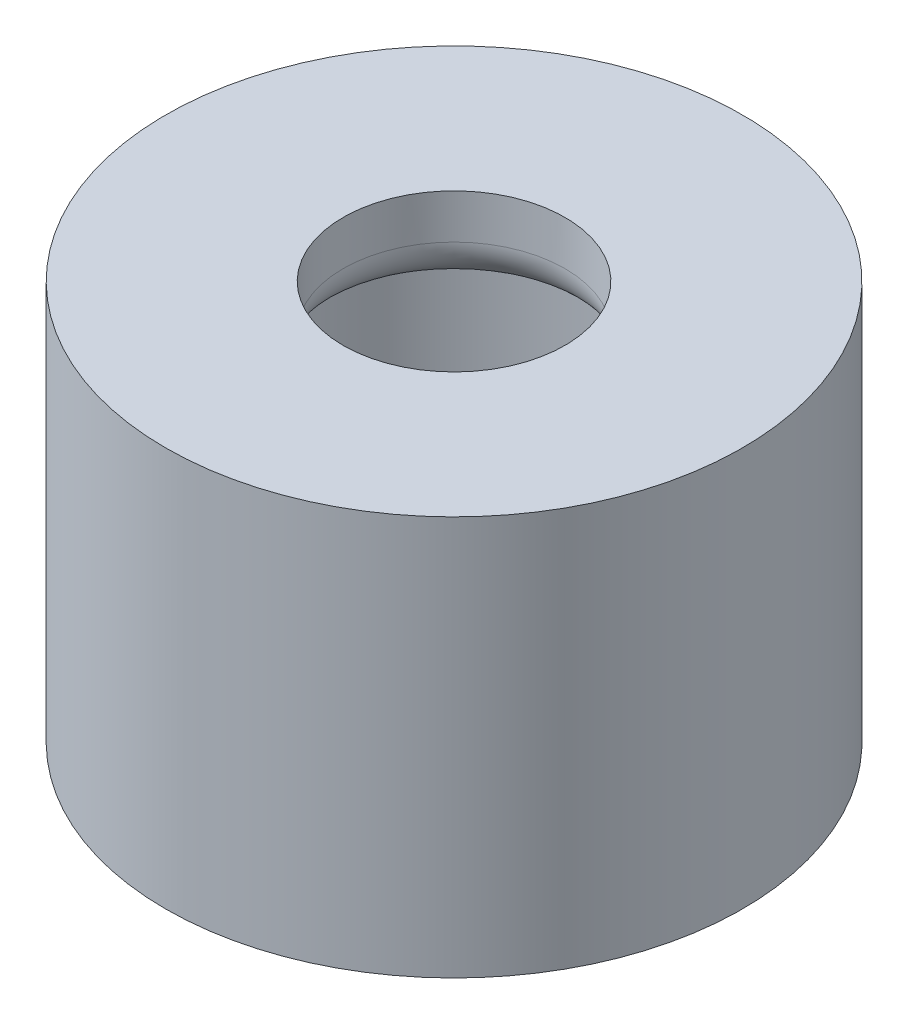
ISO-10303-21;
HEADER;
FILE_DESCRIPTION(('STEP AP214'),'2;1');
FILE_NAME('part.step','',(''),(''),'','','');
FILE_SCHEMA(('AUTOMOTIVE_DESIGN { 1 0 10303 214 1 1 1 1 }'));
ENDSEC;
DATA;
#1=APPLICATION_CONTEXT('core data for automotive mechanical design processes');
#2=APPLICATION_PROTOCOL_DEFINITION('international standard','automotive_design',2000,#1);
#3=PRODUCT_CONTEXT('',#1,'mechanical');
#4=PRODUCT('Part','Part','',(#3));
#5=PRODUCT_RELATED_PRODUCT_CATEGORY('part','',(#4));
#6=PRODUCT_DEFINITION_FORMATION('','',#4);
#7=PRODUCT_DEFINITION_CONTEXT('part definition',#1,'design');
#8=PRODUCT_DEFINITION('design','',#6,#7);
#9=PRODUCT_DEFINITION_SHAPE('','',#8);
#10=(LENGTH_UNIT() NAMED_UNIT(*) SI_UNIT(.MILLI.,.METRE.));
#11=(NAMED_UNIT(*) PLANE_ANGLE_UNIT() SI_UNIT($,.RADIAN.));
#12=(NAMED_UNIT(*) SI_UNIT($,.STERADIAN.) SOLID_ANGLE_UNIT());
#13=UNCERTAINTY_MEASURE_WITH_UNIT(LENGTH_MEASURE(1.E-05),#10,'distance_accuracy_value','');
#14=(GEOMETRIC_REPRESENTATION_CONTEXT(3) GLOBAL_UNCERTAINTY_ASSIGNED_CONTEXT((#13)) GLOBAL_UNIT_ASSIGNED_CONTEXT((#10,
#11,#12)) REPRESENTATION_CONTEXT('',''));
#15=CARTESIAN_POINT('',(0.,0.,0.));
#16=DIRECTION('',(0.,0.,1.));
#17=DIRECTION('',(1.,0.,0.));
#18=AXIS2_PLACEMENT_3D('',#15,#16,#17);
#19=CARTESIAN_POINT('',(0.,9.,0.));
#20=DIRECTION('',(0.,-1.,0.));
#21=DIRECTION('',(0.,0.,-1.));
#22=AXIS2_PLACEMENT_3D('',#19,#20,#21);
#23=CYLINDRICAL_SURFACE('',#22,6.5);
#24=CARTESIAN_POINT('',(0.,9.,0.));
#25=DIRECTION('',(0.,1.,0.));
#26=DIRECTION('',(0.,0.,1.));
#27=AXIS2_PLACEMENT_3D('',#24,#25,#26);
#28=CIRCLE('',#27,6.5);
#29=CARTESIAN_POINT('',(0.,9.,6.5));
#30=VERTEX_POINT('',#29);
#31=EDGE_CURVE('E50',#30,#30,#28,.T.);
#32=ORIENTED_EDGE('',*,*,#31,.F.);
#33=EDGE_LOOP('',(#32));
#34=FACE_BOUND('',#33,.T.);
#35=CARTESIAN_POINT('',(0.,0.,0.));
#36=DIRECTION('',(0.,1.,0.));
#37=DIRECTION('',(0.,0.,1.));
#38=AXIS2_PLACEMENT_3D('',#35,#36,#37);
#39=CIRCLE('',#38,6.5);
#40=CARTESIAN_POINT('',(0.,0.,6.5));
#41=VERTEX_POINT('',#40);
#42=EDGE_CURVE('E55',#41,#41,#39,.T.);
#43=ORIENTED_EDGE('',*,*,#42,.T.);
#44=EDGE_LOOP('',(#43));
#45=FACE_BOUND('',#44,.T.);
#46=ADVANCED_FACE('F37',(#34,#45),#23,.T.);
#47=CARTESIAN_POINT('',(0.,9.,0.));
#48=DIRECTION('',(0.,1.,0.));
#49=DIRECTION('',(0.,0.,1.));
#50=AXIS2_PLACEMENT_3D('',#47,#48,#49);
#51=PLANE('',#50);
#52=CARTESIAN_POINT('',(0.,9.,0.));
#53=DIRECTION('',(0.,1.,0.));
#54=DIRECTION('',(0.,0.,1.));
#55=AXIS2_PLACEMENT_3D('',#52,#53,#54);
#56=CIRCLE('',#55,2.5);
#57=CARTESIAN_POINT('',(0.,9.,2.5));
#58=VERTEX_POINT('',#57);
#59=EDGE_CURVE('E66',#58,#58,#56,.T.);
#60=ORIENTED_EDGE('',*,*,#59,.F.);
#61=EDGE_LOOP('',(#60));
#62=FACE_BOUND('',#61,.T.);
#63=ORIENTED_EDGE('',*,*,#31,.T.);
#64=EDGE_LOOP('',(#63));
#65=FACE_BOUND('',#64,.T.);
#66=ADVANCED_FACE('F76',(#62,#65),#51,.T.);
#67=CARTESIAN_POINT('',(0.,0.,0.));
#68=DIRECTION('',(0.,1.,0.));
#69=DIRECTION('',(0.,0.,1.));
#70=AXIS2_PLACEMENT_3D('',#67,#68,#69);
#71=PLANE('',#70);
#72=CARTESIAN_POINT('',(0.,0.,0.));
#73=DIRECTION('',(0.,-1.,0.));
#74=DIRECTION('',(0.,0.,-1.));
#75=AXIS2_PLACEMENT_3D('',#72,#73,#74);
#76=CIRCLE('',#75,4.5);
#77=CARTESIAN_POINT('',(0.,0.,-4.5));
#78=VERTEX_POINT('',#77);
#79=EDGE_CURVE('E62',#78,#78,#76,.T.);
#80=ORIENTED_EDGE('',*,*,#79,.F.);
#81=EDGE_LOOP('',(#80));
#82=FACE_BOUND('',#81,.T.);
#83=ORIENTED_EDGE('',*,*,#42,.F.);
#84=EDGE_LOOP('',(#83));
#85=FACE_BOUND('',#84,.T.);
#86=ADVANCED_FACE('F79',(#82,#85),#71,.F.);
#87=CARTESIAN_POINT('',(0.,7.,0.));
#88=DIRECTION('',(0.,-1.,0.));
#89=DIRECTION('',(0.,0.,-1.));
#90=AXIS2_PLACEMENT_3D('',#87,#88,#89);
#91=CYLINDRICAL_SURFACE('',#90,4.5);
#92=CARTESIAN_POINT('',(0.,7.,0.));
#93=DIRECTION('',(0.,-1.,0.));
#94=DIRECTION('',(0.,0.,-1.));
#95=AXIS2_PLACEMENT_3D('',#92,#93,#94);
#96=CIRCLE('',#95,4.5);
#97=CARTESIAN_POINT('',(0.,7.,-4.5));
#98=VERTEX_POINT('',#97);
#99=EDGE_CURVE('E60',#98,#98,#96,.T.);
#100=ORIENTED_EDGE('',*,*,#99,.F.);
#101=EDGE_LOOP('',(#100));
#102=FACE_BOUND('',#101,.T.);
#103=ORIENTED_EDGE('',*,*,#79,.T.);
#104=EDGE_LOOP('',(#103));
#105=FACE_BOUND('',#104,.T.);
#106=ADVANCED_FACE('F88',(#102,#105),#91,.F.);
#107=CARTESIAN_POINT('',(0.,7.,0.));
#108=DIRECTION('',(0.,-1.,0.));
#109=DIRECTION('',(0.,0.,-1.));
#110=AXIS2_PLACEMENT_3D('',#107,#108,#109);
#111=PLANE('',#110);
#112=CARTESIAN_POINT('',(0.,7.,0.));
#113=DIRECTION('',(0.,-1.,0.));
#114=DIRECTION('',(0.,0.,-1.));
#115=AXIS2_PLACEMENT_3D('',#112,#113,#114);
#116=CIRCLE('',#115,3.5);
#117=CARTESIAN_POINT('',(0.,7.,-3.5));
#118=VERTEX_POINT('',#117);
#119=EDGE_CURVE('E10',#118,#118,#116,.F.);
#120=ORIENTED_EDGE('',*,*,#119,.T.);
#121=EDGE_LOOP('',(#120));
#122=FACE_BOUND('',#121,.T.);
#123=ORIENTED_EDGE('',*,*,#99,.T.);
#124=EDGE_LOOP('',(#123));
#125=FACE_BOUND('',#124,.T.);
#126=ADVANCED_FACE('F94',(#122,#125),#111,.T.);
#127=CARTESIAN_POINT('',(0.,6.,0.));
#128=DIRECTION('',(0.,1.,0.));
#129=DIRECTION('',(0.,0.,1.));
#130=AXIS2_PLACEMENT_3D('',#127,#128,#129);
#131=CYLINDRICAL_SURFACE('',#130,2.5);
#132=CARTESIAN_POINT('',(0.,8.,0.));
#133=DIRECTION('',(0.,-1.,0.));
#134=DIRECTION('',(0.,0.,-1.));
#135=AXIS2_PLACEMENT_3D('',#132,#133,#134);
#136=CIRCLE('',#135,2.5);
#137=CARTESIAN_POINT('',(0.,8.,-2.5));
#138=VERTEX_POINT('',#137);
#139=EDGE_CURVE('E45',#138,#138,#136,.T.);
#140=ORIENTED_EDGE('',*,*,#139,.T.);
#141=EDGE_LOOP('',(#140));
#142=FACE_BOUND('',#141,.T.);
#143=ORIENTED_EDGE('',*,*,#59,.T.);
#144=EDGE_LOOP('',(#143));
#145=FACE_BOUND('',#144,.T.);
#146=ADVANCED_FACE('F74',(#142,#145),#131,.F.);
#147=CARTESIAN_POINT('',(0.,8.,0.));
#148=DIRECTION('',(0.,-1.,0.));
#149=DIRECTION('',(0.,0.,-1.));
#150=AXIS2_PLACEMENT_3D('',#147,#148,#149);
#151=TOROIDAL_SURFACE('',#150,3.5,1.);
#152=ORIENTED_EDGE('',*,*,#119,.F.);
#153=EDGE_LOOP('',(#152));
#154=FACE_BOUND('',#153,.T.);
#155=ORIENTED_EDGE('',*,*,#139,.F.);
#156=EDGE_LOOP('',(#155));
#157=FACE_BOUND('',#156,.T.);
#158=ADVANCED_FACE('F39',(#154,#157),#151,.T.);
#159=CLOSED_SHELL('',(#46,#66,#86,#106,#126,#146,#158));
#160=MANIFOLD_SOLID_BREP('B2',#159);
#161=ADVANCED_BREP_SHAPE_REPRESENTATION('',(#18,#160),#14);
#162=SHAPE_DEFINITION_REPRESENTATION(#9,#161);
ENDSEC;
END-ISO-10303-21;
